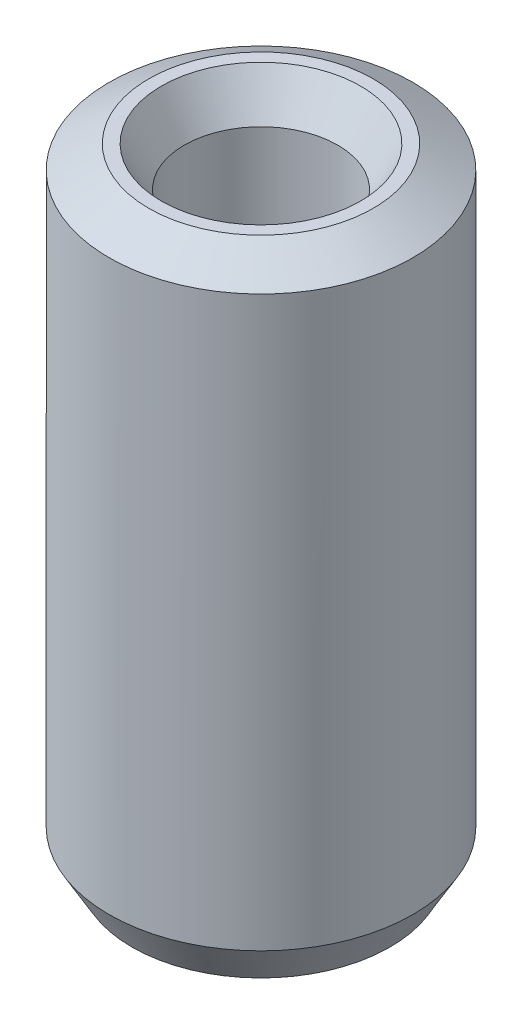
ISO-10303-21;
HEADER;
FILE_DESCRIPTION(('STEP AP214'),'2;1');
FILE_NAME('part.step','',(''),(''),'','','');
FILE_SCHEMA(('AUTOMOTIVE_DESIGN { 1 0 10303 214 1 1 1 1 }'));
ENDSEC;
DATA;
#1=APPLICATION_CONTEXT('core data for automotive mechanical design processes');
#2=APPLICATION_PROTOCOL_DEFINITION('international standard','automotive_design',2000,#1);
#3=PRODUCT_CONTEXT('',#1,'mechanical');
#4=PRODUCT('Part','Part','',(#3));
#5=PRODUCT_RELATED_PRODUCT_CATEGORY('part','',(#4));
#6=PRODUCT_DEFINITION_FORMATION('','',#4);
#7=PRODUCT_DEFINITION_CONTEXT('part definition',#1,'design');
#8=PRODUCT_DEFINITION('design','',#6,#7);
#9=PRODUCT_DEFINITION_SHAPE('','',#8);
#10=(LENGTH_UNIT() NAMED_UNIT(*) SI_UNIT(.MILLI.,.METRE.));
#11=(NAMED_UNIT(*) PLANE_ANGLE_UNIT() SI_UNIT($,.RADIAN.));
#12=(NAMED_UNIT(*) SI_UNIT($,.STERADIAN.) SOLID_ANGLE_UNIT());
#13=UNCERTAINTY_MEASURE_WITH_UNIT(LENGTH_MEASURE(1.E-05),#10,'distance_accuracy_value','');
#14=(GEOMETRIC_REPRESENTATION_CONTEXT(3) GLOBAL_UNCERTAINTY_ASSIGNED_CONTEXT((#13)) GLOBAL_UNIT_ASSIGNED_CONTEXT((#10,
#11,#12)) REPRESENTATION_CONTEXT('',''));
#15=CARTESIAN_POINT('',(0.,0.,0.));
#16=DIRECTION('',(0.,0.,1.));
#17=DIRECTION('',(1.,0.,0.));
#18=AXIS2_PLACEMENT_3D('',#15,#16,#17);
#19=CARTESIAN_POINT('',(0.,62.351916927693,0.));
#20=DIRECTION('',(0.,-1.,0.));
#21=DIRECTION('',(0.,0.,-1.));
#22=AXIS2_PLACEMENT_3D('',#19,#20,#21);
#23=CYLINDRICAL_SURFACE('',#22,15.);
#24=CARTESIAN_POINT('',(0.,3.91846582546584,0.));
#25=DIRECTION('',(0.,1.,0.));
#26=DIRECTION('',(0.,0.,1.));
#27=AXIS2_PLACEMENT_3D('',#24,#25,#26);
#28=CIRCLE('',#27,15.);
#29=CARTESIAN_POINT('',(0.,3.91846582546584,-15.));
#30=VERTEX_POINT('',#29);
#31=EDGE_CURVE('E10',#30,#30,#28,.T.);
#32=CARTESIAN_POINT('',(0.,60.0895896285501,0.));
#33=DIRECTION('',(0.,1.,0.));
#34=DIRECTION('',(0.,0.,1.));
#35=AXIS2_PLACEMENT_3D('',#32,#33,#34);
#36=CIRCLE('',#35,15.);
#37=CARTESIAN_POINT('',(0.,60.0895896285501,-15.));
#38=VERTEX_POINT('',#37);
#39=EDGE_CURVE('E50',#38,#38,#36,.F.);
#40=CARTESIAN_POINT('',(0.,3.91846582546584,-15.));
#41=CARTESIAN_POINT('',(0.,4.50358169841463,-15.));
#42=CARTESIAN_POINT('',(0.,5.08869757136342,-15.));
#43=CARTESIAN_POINT('',(0.,6.25892931726101,-15.));
#44=CARTESIAN_POINT('',(0.,6.84404519020981,-15.));
#45=CARTESIAN_POINT('',(0.,8.01427693610739,-15.));
#46=CARTESIAN_POINT('',(0.,8.59939280905619,-15.));
#47=CARTESIAN_POINT('',(0.,9.76962455495378,-15.));
#48=CARTESIAN_POINT('',(0.,10.3547404279026,-15.));
#49=CARTESIAN_POINT('',(0.,11.5249721738002,-15.));
#50=CARTESIAN_POINT('',(0.,12.110088046749,-15.));
#51=CARTESIAN_POINT('',(0.,13.2803197926465,-15.));
#52=CARTESIAN_POINT('',(0.,13.8654356655953,-15.));
#53=CARTESIAN_POINT('',(0.,15.0356674114929,-15.));
#54=CARTESIAN_POINT('',(0.,15.6207832844417,-15.));
#55=CARTESIAN_POINT('',(0.,16.7910150303393,-15.));
#56=CARTESIAN_POINT('',(0.,17.3761309032881,-15.));
#57=CARTESIAN_POINT('',(0.,18.5463626491857,-15.));
#58=CARTESIAN_POINT('',(0.,19.1314785221345,-15.));
#59=CARTESIAN_POINT('',(0.,20.3017102680321,-15.));
#60=CARTESIAN_POINT('',(0.,20.8868261409809,-15.));
#61=CARTESIAN_POINT('',(0.,22.0570578868785,-15.));
#62=CARTESIAN_POINT('',(0.,22.6421737598273,-15.));
#63=CARTESIAN_POINT('',(0.,23.8124055057248,-15.));
#64=CARTESIAN_POINT('',(0.,24.3975213786736,-15.));
#65=CARTESIAN_POINT('',(0.,25.5677531245712,-15.));
#66=CARTESIAN_POINT('',(0.,26.15286899752,-15.));
#67=CARTESIAN_POINT('',(0.,27.3231007434176,-15.));
#68=CARTESIAN_POINT('',(0.,27.9082166163664,-15.));
#69=CARTESIAN_POINT('',(0.,29.078448362264,-15.));
#70=CARTESIAN_POINT('',(0.,29.6635642352128,-15.));
#71=CARTESIAN_POINT('',(0.,30.8337959811104,-15.));
#72=CARTESIAN_POINT('',(0.,31.4189118540592,-15.));
#73=CARTESIAN_POINT('',(0.,32.5891435999567,-15.));
#74=CARTESIAN_POINT('',(0.,33.1742594729055,-15.));
#75=CARTESIAN_POINT('',(0.,34.3444912188031,-15.));
#76=CARTESIAN_POINT('',(0.,34.9296070917519,-15.));
#77=CARTESIAN_POINT('',(0.,36.0998388376495,-15.));
#78=CARTESIAN_POINT('',(0.,36.6849547105983,-15.));
#79=CARTESIAN_POINT('',(0.,37.8551864564959,-15.));
#80=CARTESIAN_POINT('',(0.,38.4403023294447,-15.));
#81=CARTESIAN_POINT('',(0.,39.6105340753423,-15.));
#82=CARTESIAN_POINT('',(0.,40.1956499482911,-15.));
#83=CARTESIAN_POINT('',(0.,41.3658816941887,-15.));
#84=CARTESIAN_POINT('',(0.,41.9509975671375,-15.));
#85=CARTESIAN_POINT('',(0.,43.1212293130351,-15.));
#86=CARTESIAN_POINT('',(0.,43.7063451859838,-15.));
#87=CARTESIAN_POINT('',(0.,44.8765769318814,-15.));
#88=CARTESIAN_POINT('',(0.,45.4616928048302,-15.));
#89=CARTESIAN_POINT('',(0.,46.6319245507278,-15.));
#90=CARTESIAN_POINT('',(0.,47.2170404236766,-15.));
#91=CARTESIAN_POINT('',(0.,48.3872721695742,-15.));
#92=CARTESIAN_POINT('',(0.,48.972388042523,-15.));
#93=CARTESIAN_POINT('',(0.,50.1426197884206,-15.));
#94=CARTESIAN_POINT('',(0.,50.7277356613694,-15.));
#95=CARTESIAN_POINT('',(0.,51.897967407267,-15.));
#96=CARTESIAN_POINT('',(0.,52.4830832802158,-15.));
#97=CARTESIAN_POINT('',(0.,53.6533150261133,-15.));
#98=CARTESIAN_POINT('',(0.,54.2384308990621,-15.));
#99=CARTESIAN_POINT('',(0.,55.4086626449597,-15.));
#100=CARTESIAN_POINT('',(0.,55.9937785179085,-15.));
#101=CARTESIAN_POINT('',(0.,57.1640102638061,-15.));
#102=CARTESIAN_POINT('',(0.,57.7491261367549,-15.));
#103=CARTESIAN_POINT('',(0.,58.9193578826525,-15.));
#104=CARTESIAN_POINT('',(0.,59.5044737556013,-15.));
#105=CARTESIAN_POINT('',(0.,60.0895896285501,-15.));
#106=B_SPLINE_CURVE_WITH_KNOTS('',3,(#40,#41,#42,#43,#44,#45,#46,#47,#48,#49,#50,#51,#52,#53,
#54,#55,#56,#57,#58,#59,#60,#61,#62,#63,#64,#65,#66,#67,#68,#69,#70,#71,#72,#73,#74,#75,#76,#77,
#78,#79,#80,#81,#82,#83,#84,#85,#86,#87,#88,#89,#90,#91,#92,#93,#94,#95,#96,#97,#98,#99,#100,
#101,#102,#103,#104,#105),.UNSPECIFIED.,.F.,.F.,(4,2,2,2,2,2,2,2,2,2,2,2,2,2,2,2,2,2,2,2,2,2,2,
2,2,2,2,2,2,2,2,2,4),(0.,1.75534761884638,3.51069523769276,5.26604285653915,7.02139047538553,
8.77673809423191,10.5320857130783,12.2874333319247,14.0427809507711,15.7981285696174,
17.5534761884638,19.3088238073102,21.0641714261566,22.819519045003,24.5748666638494,
26.3302142826957,28.0855619015421,29.8409095203885,31.5962571392349,33.3516047580813,
35.1069523769276,36.862299995774,38.6176476146204,40.3729952334668,42.1283428523132,
43.8836904711596,45.6390380900059,47.3943857088523,49.1497333276987,50.9050809465451,
52.6604285653915,54.4157761842379,56.1711238030842),.UNSPECIFIED.);
#107=EDGE_CURVE('BSEAM39',#30,#38,#106,.T.);
#108=ORIENTED_EDGE('',*,*,#31,.T.);
#109=ORIENTED_EDGE('',*,*,#39,.T.);
#110=ORIENTED_EDGE('',*,*,#107,.T.);
#111=ORIENTED_EDGE('',*,*,#107,.F.);
#112=EDGE_LOOP('',(#108,#110,#109,#111));
#113=FACE_BOUND('',#112,.T.);
#114=ADVANCED_FACE('F39',(#113),#23,.T.);
#115=CARTESIAN_POINT('',(0.,62.351916927693,0.));
#116=DIRECTION('',(0.,1.,0.));
#117=DIRECTION('',(0.,0.,1.));
#118=AXIS2_PLACEMENT_3D('',#115,#116,#117);
#119=PLANE('',#118);
#120=CARTESIAN_POINT('',(0.,62.351916927693,0.));
#121=DIRECTION('',(0.,1.,0.));
#122=DIRECTION('',(0.,0.,1.));
#123=AXIS2_PLACEMENT_3D('',#120,#121,#122);
#124=CIRCLE('',#123,9.83983042387588);
#125=CARTESIAN_POINT('',(0.,62.351916927693,9.83983042387588));
#126=VERTEX_POINT('',#125);
#127=EDGE_CURVE('E58',#126,#126,#124,.F.);
#128=ORIENTED_EDGE('',*,*,#127,.T.);
#129=EDGE_LOOP('',(#128));
#130=FACE_BOUND('',#129,.T.);
#131=CARTESIAN_POINT('',(0.,62.351916927693,0.));
#132=DIRECTION('',(0.,1.,0.));
#133=DIRECTION('',(0.,0.,1.));
#134=AXIS2_PLACEMENT_3D('',#131,#132,#133);
#135=CIRCLE('',#134,11.0815341745344);
#136=CARTESIAN_POINT('',(0.,62.351916927693,11.0815341745344));
#137=VERTEX_POINT('',#136);
#138=EDGE_CURVE('E61',#137,#137,#135,.T.);
#139=ORIENTED_EDGE('',*,*,#138,.T.);
#140=EDGE_LOOP('',(#139));
#141=FACE_BOUND('',#140,.T.);
#142=ADVANCED_FACE('F88',(#130,#141),#119,.T.);
#143=CARTESIAN_POINT('',(0.,0.,0.));
#144=DIRECTION('',(0.,1.,0.));
#145=DIRECTION('',(0.,0.,1.));
#146=AXIS2_PLACEMENT_3D('',#143,#144,#145);
#147=PLANE('',#146);
#148=CARTESIAN_POINT('',(0.,0.,0.));
#149=DIRECTION('',(0.,1.,0.));
#150=DIRECTION('',(0.,0.,1.));
#151=AXIS2_PLACEMENT_3D('',#148,#149,#150);
#152=CIRCLE('',#151,11.4959689501985);
#153=CARTESIAN_POINT('',(0.,0.,11.4959689501985));
#154=VERTEX_POINT('',#153);
#155=EDGE_CURVE('E51',#154,#154,#152,.T.);
#156=ORIENTED_EDGE('',*,*,#155,.T.);
#157=EDGE_LOOP('',(#156));
#158=FACE_BOUND('',#157,.T.);
#159=CARTESIAN_POINT('',(0.,0.,0.));
#160=DIRECTION('',(0.,1.,0.));
#161=DIRECTION('',(0.,0.,1.));
#162=AXIS2_PLACEMENT_3D('',#159,#160,#161);
#163=CIRCLE('',#162,12.7376727008569);
#164=CARTESIAN_POINT('',(0.,0.,12.7376727008569));
#165=VERTEX_POINT('',#164);
#166=EDGE_CURVE('E54',#165,#165,#163,.F.);
#167=ORIENTED_EDGE('',*,*,#166,.T.);
#168=EDGE_LOOP('',(#167));
#169=FACE_BOUND('',#168,.T.);
#170=ADVANCED_FACE('F83',(#158,#169),#147,.F.);
#171=CARTESIAN_POINT('',(0.,62.351916927693,0.));
#172=DIRECTION('',(0.,-1.,0.));
#173=DIRECTION('',(0.,0.,-1.));
#174=AXIS2_PLACEMENT_3D('',#171,#172,#173);
#175=CYLINDRICAL_SURFACE('',#174,7.57750312473285);
#176=CARTESIAN_POINT('',(0.,58.4334511022273,0.));
#177=DIRECTION('',(0.,1.,0.));
#178=DIRECTION('',(0.,0.,1.));
#179=AXIS2_PLACEMENT_3D('',#176,#177,#178);
#180=CIRCLE('',#179,7.57750312473285);
#181=CARTESIAN_POINT('',(0.,58.4334511022273,-7.57750312473285));
#182=VERTEX_POINT('',#181);
#183=EDGE_CURVE('E67',#182,#182,#180,.T.);
#184=CARTESIAN_POINT('',(0.,2.26232729914298,0.));
#185=DIRECTION('',(0.,1.,0.));
#186=DIRECTION('',(0.,0.,1.));
#187=AXIS2_PLACEMENT_3D('',#184,#185,#186);
#188=CIRCLE('',#187,7.57750312473285);
#189=CARTESIAN_POINT('',(0.,2.26232729914298,-7.57750312473285));
#190=VERTEX_POINT('',#189);
#191=EDGE_CURVE('E69',#190,#190,#188,.F.);
#192=CARTESIAN_POINT('',(0.,58.4334511022273,-7.57750312473285));
#193=CARTESIAN_POINT('',(0.,57.8483352292785,-7.57750312473285));
#194=CARTESIAN_POINT('',(0.,57.2632193563297,-7.57750312473285));
#195=CARTESIAN_POINT('',(0.,56.0929876104321,-7.57750312473285));
#196=CARTESIAN_POINT('',(0.,55.5078717374833,-7.57750312473285));
#197=CARTESIAN_POINT('',(0.,54.3376399915857,-7.57750312473285));
#198=CARTESIAN_POINT('',(0.,53.7525241186369,-7.57750312473285));
#199=CARTESIAN_POINT('',(0.,52.5822923727393,-7.57750312473285));
#200=CARTESIAN_POINT('',(0.,51.9971764997905,-7.57750312473285));
#201=CARTESIAN_POINT('',(0.,50.8269447538929,-7.57750312473285));
#202=CARTESIAN_POINT('',(0.,50.2418288809441,-7.57750312473285));
#203=CARTESIAN_POINT('',(0.,49.0715971350466,-7.57750312473285));
#204=CARTESIAN_POINT('',(0.,48.4864812620978,-7.57750312473285));
#205=CARTESIAN_POINT('',(0.,47.3162495162002,-7.57750312473285));
#206=CARTESIAN_POINT('',(0.,46.7311336432514,-7.57750312473285));
#207=CARTESIAN_POINT('',(0.,45.5609018973538,-7.57750312473285));
#208=CARTESIAN_POINT('',(0.,44.975786024405,-7.57750312473285));
#209=CARTESIAN_POINT('',(0.,43.8055542785074,-7.57750312473285));
#210=CARTESIAN_POINT('',(0.,43.2204384055586,-7.57750312473285));
#211=CARTESIAN_POINT('',(0.,42.050206659661,-7.57750312473285));
#212=CARTESIAN_POINT('',(0.,41.4650907867122,-7.57750312473285));
#213=CARTESIAN_POINT('',(0.,40.2948590408146,-7.57750312473285));
#214=CARTESIAN_POINT('',(0.,39.7097431678658,-7.57750312473285));
#215=CARTESIAN_POINT('',(0.,38.5395114219682,-7.57750312473285));
#216=CARTESIAN_POINT('',(0.,37.9543955490195,-7.57750312473285));
#217=CARTESIAN_POINT('',(0.,36.7841638031219,-7.57750312473285));
#218=CARTESIAN_POINT('',(0.,36.1990479301731,-7.57750312473285));
#219=CARTESIAN_POINT('',(0.,35.0288161842755,-7.57750312473285));
#220=CARTESIAN_POINT('',(0.,34.4437003113267,-7.57750312473285));
#221=CARTESIAN_POINT('',(0.,33.2734685654291,-7.57750312473285));
#222=CARTESIAN_POINT('',(0.,32.6883526924803,-7.57750312473285));
#223=CARTESIAN_POINT('',(0.,31.5181209465827,-7.57750312473285));
#224=CARTESIAN_POINT('',(0.,30.9330050736339,-7.57750312473285));
#225=CARTESIAN_POINT('',(0.,29.7627733277363,-7.57750312473285));
#226=CARTESIAN_POINT('',(0.,29.1776574547875,-7.57750312473285));
#227=CARTESIAN_POINT('',(0.,28.0074257088899,-7.57750312473285));
#228=CARTESIAN_POINT('',(0.,27.4223098359412,-7.57750312473285));
#229=CARTESIAN_POINT('',(0.,26.2520780900436,-7.57750312473285));
#230=CARTESIAN_POINT('',(0.,25.6669622170948,-7.57750312473285));
#231=CARTESIAN_POINT('',(0.,24.4967304711972,-7.57750312473285));
#232=CARTESIAN_POINT('',(0.,23.9116145982484,-7.57750312473285));
#233=CARTESIAN_POINT('',(0.,22.7413828523508,-7.57750312473285));
#234=CARTESIAN_POINT('',(0.,22.156266979402,-7.57750312473285));
#235=CARTESIAN_POINT('',(0.,20.9860352335044,-7.57750312473285));
#236=CARTESIAN_POINT('',(0.,20.4009193605556,-7.57750312473285));
#237=CARTESIAN_POINT('',(0.,19.230687614658,-7.57750312473285));
#238=CARTESIAN_POINT('',(0.,18.6455717417092,-7.57750312473285));
#239=CARTESIAN_POINT('',(0.,17.4753399958116,-7.57750312473285));
#240=CARTESIAN_POINT('',(0.,16.8902241228628,-7.57750312473285));
#241=CARTESIAN_POINT('',(0.,15.7199923769653,-7.57750312473285));
#242=CARTESIAN_POINT('',(0.,15.1348765040165,-7.57750312473285));
#243=CARTESIAN_POINT('',(0.,13.9646447581189,-7.57750312473285));
#244=CARTESIAN_POINT('',(0.,13.3795288851701,-7.57750312473285));
#245=CARTESIAN_POINT('',(0.,12.2092971392725,-7.57750312473285));
#246=CARTESIAN_POINT('',(0.,11.6241812663237,-7.57750312473285));
#247=CARTESIAN_POINT('',(0.,10.4539495204261,-7.57750312473285));
#248=CARTESIAN_POINT('',(0.,9.86883364747731,-7.57750312473285));
#249=CARTESIAN_POINT('',(0.,8.69860190157972,-7.57750312473285));
#250=CARTESIAN_POINT('',(0.,8.11348602863093,-7.57750312473285));
#251=CARTESIAN_POINT('',(0.,6.94325428273334,-7.57750312473285));
#252=CARTESIAN_POINT('',(0.,6.35813840978455,-7.57750312473285));
#253=CARTESIAN_POINT('',(0.,5.18790666388695,-7.57750312473285));
#254=CARTESIAN_POINT('',(0.,4.60279079093816,-7.57750312473285));
#255=CARTESIAN_POINT('',(0.,3.43255904504056,-7.57750312473285));
#256=CARTESIAN_POINT('',(0.,2.84744317209177,-7.57750312473285));
#257=CARTESIAN_POINT('',(0.,2.26232729914298,-7.57750312473285));
#258=B_SPLINE_CURVE_WITH_KNOTS('',3,(#192,#193,#194,#195,#196,#197,#198,#199,#200,#201,#202,
#203,#204,#205,#206,#207,#208,#209,#210,#211,#212,#213,#214,#215,#216,#217,#218,#219,#220,#221,
#222,#223,#224,#225,#226,#227,#228,#229,#230,#231,#232,#233,#234,#235,#236,#237,#238,#239,#240,
#241,#242,#243,#244,#245,#246,#247,#248,#249,#250,#251,#252,#253,#254,#255,#256,#257),
.UNSPECIFIED.,.F.,.F.,(4,2,2,2,2,2,2,2,2,2,2,2,2,2,2,2,2,2,2,2,2,2,2,2,2,2,2,2,2,2,2,2,4),(0.,
1.75534761884639,3.51069523769277,5.26604285653915,7.02139047538554,8.77673809423193,
10.5320857130783,12.2874333319247,14.0427809507711,15.7981285696175,17.5534761884638,
19.3088238073102,21.0641714261566,22.819519045003,24.5748666638494,26.3302142826958,
28.0855619015421,29.8409095203885,31.5962571392349,33.3516047580813,35.1069523769277,
36.8622999957741,38.6176476146205,40.3729952334668,42.1283428523132,43.8836904711596,
45.639038090006,47.3943857088524,49.1497333276988,50.9050809465451,52.6604285653915,
54.4157761842379,56.1711238030843),.UNSPECIFIED.);
#259=EDGE_CURVE('BSEAM71',#182,#190,#258,.T.);
#260=ORIENTED_EDGE('',*,*,#183,.T.);
#261=ORIENTED_EDGE('',*,*,#191,.T.);
#262=ORIENTED_EDGE('',*,*,#259,.T.);
#263=ORIENTED_EDGE('',*,*,#259,.F.);
#264=EDGE_LOOP('',(#260,#262,#261,#263));
#265=FACE_BOUND('',#264,.T.);
#266=ADVANCED_FACE('F71',(#265),#175,.F.);
#267=CARTESIAN_POINT('',(0.,58.4334511022273,0.));
#268=DIRECTION('',(0.,1.,0.));
#269=DIRECTION('',(0.,0.,1.));
#270=AXIS2_PLACEMENT_3D('',#267,#268,#269);
#271=CONICAL_SURFACE('',#270,7.57750312473285,0.523598775598303);
#272=ORIENTED_EDGE('',*,*,#127,.F.);
#273=EDGE_LOOP('',(#272));
#274=FACE_BOUND('',#273,.T.);
#275=ORIENTED_EDGE('',*,*,#183,.F.);
#276=EDGE_LOOP('',(#275));
#277=FACE_BOUND('',#276,.T.);
#278=ADVANCED_FACE('F77',(#274,#277),#271,.F.);
#279=CARTESIAN_POINT('',(0.,0.,0.));
#280=DIRECTION('',(0.,-1.,0.));
#281=DIRECTION('',(0.,0.,-1.));
#282=AXIS2_PLACEMENT_3D('',#279,#280,#281);
#283=CONICAL_SURFACE('',#282,11.4959689501985,1.04719755119659);
#284=ORIENTED_EDGE('',*,*,#191,.F.);
#285=EDGE_LOOP('',(#284));
#286=FACE_BOUND('',#285,.T.);
#287=ORIENTED_EDGE('',*,*,#155,.F.);
#288=EDGE_LOOP('',(#287));
#289=FACE_BOUND('',#288,.T.);
#290=ADVANCED_FACE('F73',(#286,#289),#283,.F.);
#291=CARTESIAN_POINT('',(0.,3.91846582546584,0.));
#292=DIRECTION('',(0.,1.,0.));
#293=DIRECTION('',(0.,0.,1.));
#294=AXIS2_PLACEMENT_3D('',#291,#292,#293);
#295=CONICAL_SURFACE('',#294,15.,0.523598775598303);
#296=ORIENTED_EDGE('',*,*,#166,.F.);
#297=EDGE_LOOP('',(#296));
#298=FACE_BOUND('',#297,.T.);
#299=ORIENTED_EDGE('',*,*,#31,.F.);
#300=EDGE_LOOP('',(#299));
#301=FACE_BOUND('',#300,.T.);
#302=ADVANCED_FACE('F76',(#298,#301),#295,.T.);
#303=CARTESIAN_POINT('',(0.,62.351916927693,0.));
#304=DIRECTION('',(0.,-1.,0.));
#305=DIRECTION('',(0.,0.,-1.));
#306=AXIS2_PLACEMENT_3D('',#303,#304,#305);
#307=CONICAL_SURFACE('',#306,11.0815341745344,1.04719755119659);
#308=ORIENTED_EDGE('',*,*,#39,.F.);
#309=EDGE_LOOP('',(#308));
#310=FACE_BOUND('',#309,.T.);
#311=ORIENTED_EDGE('',*,*,#138,.F.);
#312=EDGE_LOOP('',(#311));
#313=FACE_BOUND('',#312,.T.);
#314=ADVANCED_FACE('F45',(#310,#313),#307,.T.);
#315=CLOSED_SHELL('',(#114,#142,#170,#266,#278,#290,#302,#314));
#316=MANIFOLD_SOLID_BREP('B2',#315);
#317=ADVANCED_BREP_SHAPE_REPRESENTATION('',(#18,#316),#14);
#318=SHAPE_DEFINITION_REPRESENTATION(#9,#317);
ENDSEC;
END-ISO-10303-21;
